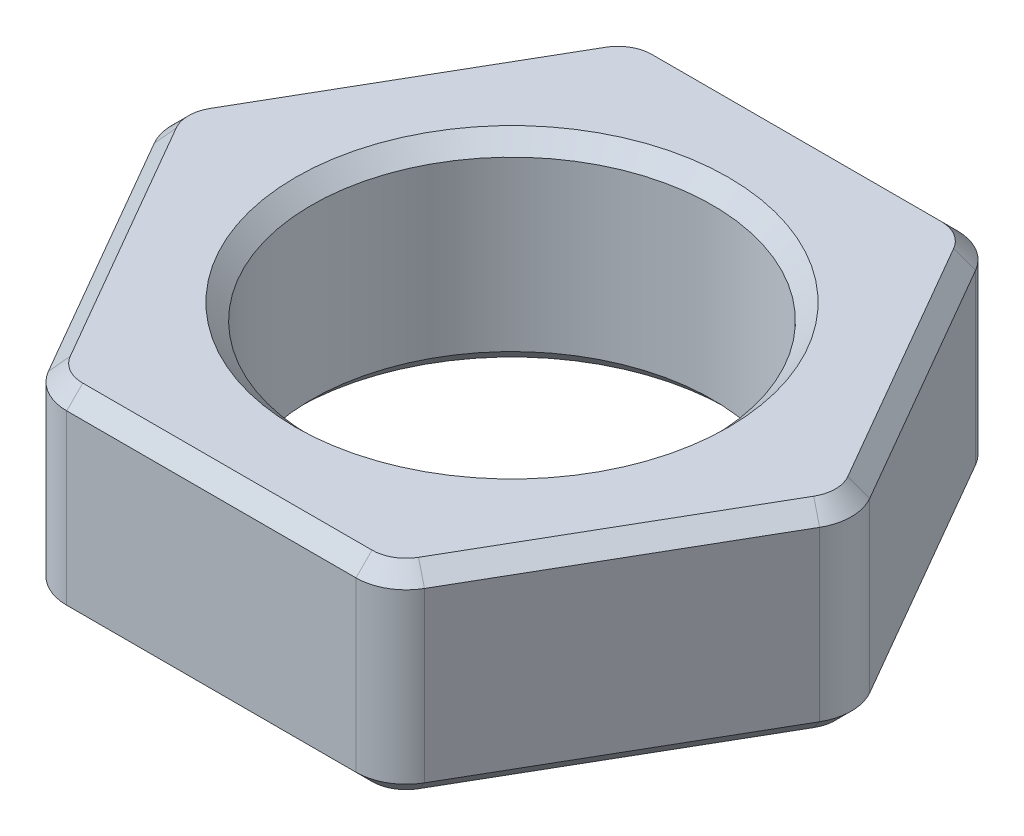
ISO-10303-21;
HEADER;
FILE_DESCRIPTION(('STEP AP214'),'2;1');
FILE_NAME('part.step','',(''),(''),'','','');
FILE_SCHEMA(('AUTOMOTIVE_DESIGN { 1 0 10303 214 1 1 1 1 }'));
ENDSEC;
DATA;
#1=APPLICATION_CONTEXT('core data for automotive mechanical design processes');
#2=APPLICATION_PROTOCOL_DEFINITION('international standard','automotive_design',2000,#1);
#3=PRODUCT_CONTEXT('',#1,'mechanical');
#4=PRODUCT('Part','Part','',(#3));
#5=PRODUCT_RELATED_PRODUCT_CATEGORY('part','',(#4));
#6=PRODUCT_DEFINITION_FORMATION('','',#4);
#7=PRODUCT_DEFINITION_CONTEXT('part definition',#1,'design');
#8=PRODUCT_DEFINITION('design','',#6,#7);
#9=PRODUCT_DEFINITION_SHAPE('','',#8);
#10=(LENGTH_UNIT() NAMED_UNIT(*) SI_UNIT(.MILLI.,.METRE.));
#11=(NAMED_UNIT(*) PLANE_ANGLE_UNIT() SI_UNIT($,.RADIAN.));
#12=(NAMED_UNIT(*) SI_UNIT($,.STERADIAN.) SOLID_ANGLE_UNIT());
#13=UNCERTAINTY_MEASURE_WITH_UNIT(LENGTH_MEASURE(1.E-05),#10,'distance_accuracy_value','');
#14=(GEOMETRIC_REPRESENTATION_CONTEXT(3) GLOBAL_UNCERTAINTY_ASSIGNED_CONTEXT((#13)) GLOBAL_UNIT_ASSIGNED_CONTEXT((#10,
#11,#12)) REPRESENTATION_CONTEXT('',''));
#15=CARTESIAN_POINT('',(0.,0.,0.));
#16=DIRECTION('',(0.,0.,1.));
#17=DIRECTION('',(1.,0.,0.));
#18=AXIS2_PLACEMENT_3D('',#15,#16,#17);
#19=CARTESIAN_POINT('',(0.,1.5875,0.));
#20=DIRECTION('',(0.,1.,0.));
#21=DIRECTION('',(0.,0.,1.));
#22=AXIS2_PLACEMENT_3D('',#19,#20,#21);
#23=PLANE('',#22);
#24=CARTESIAN_POINT('',(0.,1.5875,0.));
#25=DIRECTION('',(0.,1.,0.));
#26=DIRECTION('',(0.,0.,1.));
#27=AXIS2_PLACEMENT_3D('',#24,#25,#26);
#28=CIRCLE('',#27,3.429);
#29=CARTESIAN_POINT('',(0.,1.5875,3.429));
#30=VERTEX_POINT('',#29);
#31=EDGE_CURVE('E11',#30,#30,#28,.F.);
#32=ORIENTED_EDGE('',*,*,#31,.T.);
#33=EDGE_LOOP('',(#32));
#34=FACE_BOUND('',#33,.T.);
#35=DIRECTION('',(-1.,0.,0.));
#36=VECTOR('',#35,1.);
#37=CARTESIAN_POINT('',(-2.29135888084633,1.5875,-4.5085));
#38=LINE('',#37,#36);
#39=CARTESIAN_POINT('',(2.29135888084633,1.5875,-4.5085));
#40=VERTEX_POINT('',#39);
#41=CARTESIAN_POINT('',(-2.29135888084633,1.5875,-4.5085));
#42=VERTEX_POINT('',#41);
#43=EDGE_CURVE('E49',#40,#42,#38,.T.);
#44=ORIENTED_EDGE('',*,*,#43,.T.);
#45=CARTESIAN_POINT('',(-2.29135888084633,1.5875,-3.96875));
#46=DIRECTION('',(0.,1.,0.));
#47=DIRECTION('',(0.,0.,1.));
#48=AXIS2_PLACEMENT_3D('',#45,#46,#47);
#49=CIRCLE('',#48,0.539750000000003);
#50=CARTESIAN_POINT('',(-2.75879609253898,1.5875,-4.238625));
#51=VERTEX_POINT('',#50);
#52=EDGE_CURVE('E41',#42,#51,#49,.T.);
#53=ORIENTED_EDGE('',*,*,#52,.T.);
#54=DIRECTION('',(-0.5,0.,0.866025403784439));
#55=VECTOR('',#54,1.);
#56=CARTESIAN_POINT('',(-5.05015497338531,1.5875,-0.269875000000002));
#57=LINE('',#56,#55);
#58=CARTESIAN_POINT('',(-5.05015497338531,1.5875,-0.269875000000002));
#59=VERTEX_POINT('',#58);
#60=EDGE_CURVE('E283',#51,#59,#57,.T.);
#61=ORIENTED_EDGE('',*,*,#60,.T.);
#62=CARTESIAN_POINT('',(-4.58271776169265,1.5875,0.));
#63=DIRECTION('',(0.,1.,0.));
#64=DIRECTION('',(0.,0.,1.));
#65=AXIS2_PLACEMENT_3D('',#62,#63,#64);
#66=CIRCLE('',#65,0.539750000000002);
#67=CARTESIAN_POINT('',(-5.0501549733853,1.5875,0.269875000000002));
#68=VERTEX_POINT('',#67);
#69=EDGE_CURVE('E285',#59,#68,#66,.T.);
#70=ORIENTED_EDGE('',*,*,#69,.T.);
#71=DIRECTION('',(0.5,0.,0.866025403784439));
#72=VECTOR('',#71,1.);
#73=CARTESIAN_POINT('',(-2.75879609253897,1.5875,4.23862500000001));
#74=LINE('',#73,#72);
#75=CARTESIAN_POINT('',(-2.75879609253897,1.5875,4.23862500000001));
#76=VERTEX_POINT('',#75);
#77=EDGE_CURVE('E287',#68,#76,#74,.T.);
#78=ORIENTED_EDGE('',*,*,#77,.T.);
#79=CARTESIAN_POINT('',(-2.29135888084632,1.5875,3.96875));
#80=DIRECTION('',(0.,1.,0.));
#81=DIRECTION('',(0.,0.,1.));
#82=AXIS2_PLACEMENT_3D('',#79,#80,#81);
#83=CIRCLE('',#82,0.539750000000002);
#84=CARTESIAN_POINT('',(-2.29135888084632,1.5875,4.50850000000001));
#85=VERTEX_POINT('',#84);
#86=EDGE_CURVE('E289',#76,#85,#83,.T.);
#87=ORIENTED_EDGE('',*,*,#86,.T.);
#88=DIRECTION('',(1.,0.,0.));
#89=VECTOR('',#88,1.);
#90=CARTESIAN_POINT('',(2.29135888084633,1.5875,4.50850000000001));
#91=LINE('',#90,#89);
#92=CARTESIAN_POINT('',(2.29135888084633,1.5875,4.50850000000001));
#93=VERTEX_POINT('',#92);
#94=EDGE_CURVE('E291',#85,#93,#91,.T.);
#95=ORIENTED_EDGE('',*,*,#94,.T.);
#96=CARTESIAN_POINT('',(2.29135888084633,1.5875,3.96875));
#97=DIRECTION('',(0.,1.,0.));
#98=DIRECTION('',(0.,0.,1.));
#99=AXIS2_PLACEMENT_3D('',#96,#97,#98);
#100=CIRCLE('',#99,0.539750000000003);
#101=CARTESIAN_POINT('',(2.75879609253898,1.5875,4.238625));
#102=VERTEX_POINT('',#101);
#103=EDGE_CURVE('E293',#93,#102,#100,.T.);
#104=ORIENTED_EDGE('',*,*,#103,.T.);
#105=DIRECTION('',(0.5,0.,-0.866025403784439));
#106=VECTOR('',#105,1.);
#107=CARTESIAN_POINT('',(5.05015497338531,1.5875,0.269874999999998));
#108=LINE('',#107,#106);
#109=CARTESIAN_POINT('',(5.05015497338531,1.5875,0.269874999999998));
#110=VERTEX_POINT('',#109);
#111=EDGE_CURVE('E295',#102,#110,#108,.T.);
#112=ORIENTED_EDGE('',*,*,#111,.T.);
#113=CARTESIAN_POINT('',(4.58271776169266,1.5875,0.));
#114=DIRECTION('',(0.,1.,0.));
#115=DIRECTION('',(0.,0.,1.));
#116=AXIS2_PLACEMENT_3D('',#113,#114,#115);
#117=CIRCLE('',#116,0.539750000000003);
#118=CARTESIAN_POINT('',(5.05015497338531,1.5875,-0.269875000000004));
#119=VERTEX_POINT('',#118);
#120=EDGE_CURVE('E297',#110,#119,#117,.T.);
#121=ORIENTED_EDGE('',*,*,#120,.T.);
#122=DIRECTION('',(-0.5,0.,-0.866025403784439));
#123=VECTOR('',#122,1.);
#124=CARTESIAN_POINT('',(2.75879609253898,1.5875,-4.238625));
#125=LINE('',#124,#123);
#126=CARTESIAN_POINT('',(2.75879609253898,1.5875,-4.238625));
#127=VERTEX_POINT('',#126);
#128=EDGE_CURVE('E299',#119,#127,#125,.T.);
#129=ORIENTED_EDGE('',*,*,#128,.T.);
#130=CARTESIAN_POINT('',(2.29135888084633,1.5875,-3.96875));
#131=DIRECTION('',(0.,1.,0.));
#132=DIRECTION('',(0.,0.,1.));
#133=AXIS2_PLACEMENT_3D('',#130,#131,#132);
#134=CIRCLE('',#133,0.539750000000002);
#135=EDGE_CURVE('E54',#127,#40,#134,.T.);
#136=ORIENTED_EDGE('',*,*,#135,.T.);
#137=EDGE_LOOP('',(#44,#53,#61,#70,#78,#87,#95,#104,#112,#121,#129,#136));
#138=FACE_BOUND('',#137,.T.);
#139=ADVANCED_FACE('F32',(#34,#138),#23,.T.);
#140=CARTESIAN_POINT('',(0.,-1.5875,0.));
#141=DIRECTION('',(0.,1.,0.));
#142=DIRECTION('',(0.,0.,1.));
#143=AXIS2_PLACEMENT_3D('',#140,#141,#142);
#144=PLANE('',#143);
#145=CARTESIAN_POINT('',(0.,-1.5875,0.));
#146=DIRECTION('',(0.,1.,0.));
#147=DIRECTION('',(0.,0.,1.));
#148=AXIS2_PLACEMENT_3D('',#145,#146,#147);
#149=CIRCLE('',#148,3.429);
#150=CARTESIAN_POINT('',(0.,-1.5875,3.429));
#151=VERTEX_POINT('',#150);
#152=EDGE_CURVE('E221',#151,#151,#149,.T.);
#153=ORIENTED_EDGE('',*,*,#152,.T.);
#154=EDGE_LOOP('',(#153));
#155=FACE_BOUND('',#154,.T.);
#156=DIRECTION('',(-1.,0.,0.));
#157=VECTOR('',#156,1.);
#158=CARTESIAN_POINT('',(0.,-1.5875,4.5085));
#159=LINE('',#158,#157);
#160=CARTESIAN_POINT('',(2.29135888084633,-1.5875,4.5085));
#161=VERTEX_POINT('',#160);
#162=CARTESIAN_POINT('',(-2.29135888084632,-1.5875,4.5085));
#163=VERTEX_POINT('',#162);
#164=EDGE_CURVE('E219',#161,#163,#159,.T.);
#165=ORIENTED_EDGE('',*,*,#164,.T.);
#166=CARTESIAN_POINT('',(-2.29135888084632,-1.5875,3.96875));
#167=DIRECTION('',(0.,1.,0.));
#168=DIRECTION('',(0.,0.,1.));
#169=AXIS2_PLACEMENT_3D('',#166,#167,#168);
#170=CIRCLE('',#169,0.539749999999996);
#171=CARTESIAN_POINT('',(-2.75879609253897,-1.5875,4.238625));
#172=VERTEX_POINT('',#171);
#173=EDGE_CURVE('E200',#163,#172,#170,.F.);
#174=ORIENTED_EDGE('',*,*,#173,.T.);
#175=DIRECTION('',(-0.5,0.,-0.866025403784439));
#176=VECTOR('',#175,1.);
#177=CARTESIAN_POINT('',(-3.90447553296214,-1.5875,2.25425));
#178=LINE('',#177,#176);
#179=CARTESIAN_POINT('',(-5.0501549733853,-1.5875,0.269874999999999));
#180=VERTEX_POINT('',#179);
#181=EDGE_CURVE('E208',#172,#180,#178,.T.);
#182=ORIENTED_EDGE('',*,*,#181,.T.);
#183=CARTESIAN_POINT('',(-4.58271776169265,-1.5875,0.));
#184=DIRECTION('',(0.,1.,0.));
#185=DIRECTION('',(0.,0.,1.));
#186=AXIS2_PLACEMENT_3D('',#183,#184,#185);
#187=CIRCLE('',#186,0.539749999999996);
#188=CARTESIAN_POINT('',(-5.0501549733853,-1.5875,-0.269874999999999));
#189=VERTEX_POINT('',#188);
#190=EDGE_CURVE('E214',#180,#189,#187,.F.);
#191=ORIENTED_EDGE('',*,*,#190,.T.);
#192=DIRECTION('',(0.5,0.,-0.866025403784439));
#193=VECTOR('',#192,1.);
#194=CARTESIAN_POINT('',(-3.90447553296214,-1.5875,-2.25425));
#195=LINE('',#194,#193);
#196=CARTESIAN_POINT('',(-2.75879609253897,-1.5875,-4.238625));
#197=VERTEX_POINT('',#196);
#198=EDGE_CURVE('E399',#189,#197,#195,.T.);
#199=ORIENTED_EDGE('',*,*,#198,.T.);
#200=CARTESIAN_POINT('',(-2.29135888084633,-1.5875,-3.96875));
#201=DIRECTION('',(0.,1.,0.));
#202=DIRECTION('',(0.,0.,1.));
#203=AXIS2_PLACEMENT_3D('',#200,#201,#202);
#204=CIRCLE('',#203,0.539749999999997);
#205=CARTESIAN_POINT('',(-2.29135888084633,-1.5875,-4.5085));
#206=VERTEX_POINT('',#205);
#207=EDGE_CURVE('E401',#197,#206,#204,.F.);
#208=ORIENTED_EDGE('',*,*,#207,.T.);
#209=DIRECTION('',(1.,0.,0.));
#210=VECTOR('',#209,1.);
#211=CARTESIAN_POINT('',(0.,-1.5875,-4.5085));
#212=LINE('',#211,#210);
#213=CARTESIAN_POINT('',(2.29135888084633,-1.5875,-4.5085));
#214=VERTEX_POINT('',#213);
#215=EDGE_CURVE('E403',#206,#214,#212,.T.);
#216=ORIENTED_EDGE('',*,*,#215,.T.);
#217=CARTESIAN_POINT('',(2.29135888084633,-1.5875,-3.96875));
#218=DIRECTION('',(0.,1.,0.));
#219=DIRECTION('',(0.,0.,1.));
#220=AXIS2_PLACEMENT_3D('',#217,#218,#219);
#221=CIRCLE('',#220,0.539749999999997);
#222=CARTESIAN_POINT('',(2.75879609253897,-1.5875,-4.238625));
#223=VERTEX_POINT('',#222);
#224=EDGE_CURVE('E405',#214,#223,#221,.F.);
#225=ORIENTED_EDGE('',*,*,#224,.T.);
#226=DIRECTION('',(0.5,0.,0.866025403784439));
#227=VECTOR('',#226,1.);
#228=CARTESIAN_POINT('',(3.90447553296214,-1.5875,-2.25425));
#229=LINE('',#228,#227);
#230=CARTESIAN_POINT('',(5.0501549733853,-1.5875,-0.269875000000001));
#231=VERTEX_POINT('',#230);
#232=EDGE_CURVE('E407',#223,#231,#229,.T.);
#233=ORIENTED_EDGE('',*,*,#232,.T.);
#234=CARTESIAN_POINT('',(4.58271776169266,-1.5875,0.));
#235=DIRECTION('',(0.,1.,0.));
#236=DIRECTION('',(0.,0.,1.));
#237=AXIS2_PLACEMENT_3D('',#234,#235,#236);
#238=CIRCLE('',#237,0.539749999999997);
#239=CARTESIAN_POINT('',(5.0501549733853,-1.5875,0.269874999999995));
#240=VERTEX_POINT('',#239);
#241=EDGE_CURVE('E409',#231,#240,#238,.F.);
#242=ORIENTED_EDGE('',*,*,#241,.T.);
#243=DIRECTION('',(-0.5,0.,0.866025403784439));
#244=VECTOR('',#243,1.);
#245=CARTESIAN_POINT('',(3.90447553296214,-1.5875,2.25425));
#246=LINE('',#245,#244);
#247=CARTESIAN_POINT('',(2.75879609253898,-1.5875,4.238625));
#248=VERTEX_POINT('',#247);
#249=EDGE_CURVE('E411',#240,#248,#246,.T.);
#250=ORIENTED_EDGE('',*,*,#249,.T.);
#251=CARTESIAN_POINT('',(2.29135888084633,-1.5875,3.96875));
#252=DIRECTION('',(0.,1.,0.));
#253=DIRECTION('',(0.,0.,1.));
#254=AXIS2_PLACEMENT_3D('',#251,#252,#253);
#255=CIRCLE('',#254,0.539749999999997);
#256=EDGE_CURVE('E226',#248,#161,#255,.F.);
#257=ORIENTED_EDGE('',*,*,#256,.T.);
#258=EDGE_LOOP('',(#165,#174,#182,#191,#199,#208,#216,#225,#233,#242,#250,#257));
#259=FACE_BOUND('',#258,.T.);
#260=ADVANCED_FACE('F217',(#155,#259),#144,.F.);
#261=CARTESIAN_POINT('',(5.49926131403119,1.5875,0.));
#262=DIRECTION('',(-0.866025403784438,0.,0.5));
#263=DIRECTION('',(0.5,0.,0.866025403784439));
#264=AXIS2_PLACEMENT_3D('',#261,#262,#263);
#265=PLANE('',#264);
#266=DIRECTION('',(0.,-1.,0.));
#267=VECTOR('',#266,1.);
#268=CARTESIAN_POINT('',(5.27012542594655,1.5875,-0.396875000000003));
#269=LINE('',#268,#267);
#270=CARTESIAN_POINT('',(5.27012542594655,1.3335,-0.396875000000003));
#271=VERTEX_POINT('',#270);
#272=CARTESIAN_POINT('',(5.27012542594655,-1.3335,-0.396875000000003));
#273=VERTEX_POINT('',#272);
#274=EDGE_CURVE('E445',#271,#273,#269,.T.);
#275=ORIENTED_EDGE('',*,*,#274,.T.);
#276=DIRECTION('',(-0.5,0.,-0.866025403784439));
#277=VECTOR('',#276,1.);
#278=CARTESIAN_POINT('',(5.49926131403119,-1.3335,0.));
#279=LINE('',#278,#277);
#280=CARTESIAN_POINT('',(2.97876654510023,-1.3335,-4.365625));
#281=VERTEX_POINT('',#280);
#282=EDGE_CURVE('E256',#273,#281,#279,.T.);
#283=ORIENTED_EDGE('',*,*,#282,.T.);
#284=DIRECTION('',(0.,-1.,0.));
#285=VECTOR('',#284,1.);
#286=CARTESIAN_POINT('',(2.97876654510023,1.5875,-4.365625));
#287=LINE('',#286,#285);
#288=CARTESIAN_POINT('',(2.97876654510023,1.3335,-4.365625));
#289=VERTEX_POINT('',#288);
#290=EDGE_CURVE('E448',#281,#289,#287,.F.);
#291=ORIENTED_EDGE('',*,*,#290,.T.);
#292=DIRECTION('',(0.5,0.,0.866025403784439));
#293=VECTOR('',#292,1.);
#294=CARTESIAN_POINT('',(5.27012542594655,1.3335,-0.396875000000003));
#295=LINE('',#294,#293);
#296=EDGE_CURVE('E254',#289,#271,#295,.T.);
#297=ORIENTED_EDGE('',*,*,#296,.T.);
#298=EDGE_LOOP('',(#275,#283,#291,#297));
#299=FACE_BOUND('',#298,.T.);
#300=ADVANCED_FACE('F468',(#299),#265,.F.);
#301=CARTESIAN_POINT('',(2.74963065701559,1.5875,-4.7625));
#302=DIRECTION('',(0.,0.,1.));
#303=DIRECTION('',(1.,0.,0.));
#304=AXIS2_PLACEMENT_3D('',#301,#302,#303);
#305=PLANE('',#304);
#306=DIRECTION('',(0.,-1.,0.));
#307=VECTOR('',#306,1.);
#308=CARTESIAN_POINT('',(2.29135888084633,1.5875,-4.7625));
#309=LINE('',#308,#307);
#310=CARTESIAN_POINT('',(2.29135888084633,1.3335,-4.7625));
#311=VERTEX_POINT('',#310);
#312=CARTESIAN_POINT('',(2.29135888084633,-1.3335,-4.7625));
#313=VERTEX_POINT('',#312);
#314=EDGE_CURVE('E439',#311,#313,#309,.T.);
#315=ORIENTED_EDGE('',*,*,#314,.T.);
#316=DIRECTION('',(-1.,0.,0.));
#317=VECTOR('',#316,1.);
#318=CARTESIAN_POINT('',(2.74963065701559,-1.3335,-4.7625));
#319=LINE('',#318,#317);
#320=CARTESIAN_POINT('',(-2.29135888084633,-1.3335,-4.7625));
#321=VERTEX_POINT('',#320);
#322=EDGE_CURVE('E264',#313,#321,#319,.T.);
#323=ORIENTED_EDGE('',*,*,#322,.T.);
#324=DIRECTION('',(0.,-1.,0.));
#325=VECTOR('',#324,1.);
#326=CARTESIAN_POINT('',(-2.29135888084633,1.5875,-4.7625));
#327=LINE('',#326,#325);
#328=CARTESIAN_POINT('',(-2.29135888084633,1.3335,-4.7625));
#329=VERTEX_POINT('',#328);
#330=EDGE_CURVE('E442',#321,#329,#327,.F.);
#331=ORIENTED_EDGE('',*,*,#330,.T.);
#332=DIRECTION('',(1.,0.,0.));
#333=VECTOR('',#332,1.);
#334=CARTESIAN_POINT('',(2.29135888084633,1.3335,-4.7625));
#335=LINE('',#334,#333);
#336=EDGE_CURVE('E262',#329,#311,#335,.T.);
#337=ORIENTED_EDGE('',*,*,#336,.T.);
#338=EDGE_LOOP('',(#315,#323,#331,#337));
#339=FACE_BOUND('',#338,.T.);
#340=ADVANCED_FACE('F486',(#339),#305,.F.);
#341=CARTESIAN_POINT('',(-2.74963065701559,1.5875,-4.7625));
#342=DIRECTION('',(0.866025403784439,0.,0.5));
#343=DIRECTION('',(0.5,0.,-0.866025403784439));
#344=AXIS2_PLACEMENT_3D('',#341,#342,#343);
#345=PLANE('',#344);
#346=DIRECTION('',(0.,-1.,0.));
#347=VECTOR('',#346,1.);
#348=CARTESIAN_POINT('',(-2.97876654510023,1.5875,-4.365625));
#349=LINE('',#348,#347);
#350=CARTESIAN_POINT('',(-2.97876654510023,1.3335,-4.365625));
#351=VERTEX_POINT('',#350);
#352=CARTESIAN_POINT('',(-2.97876654510023,-1.3335,-4.365625));
#353=VERTEX_POINT('',#352);
#354=EDGE_CURVE('E431',#351,#353,#349,.T.);
#355=ORIENTED_EDGE('',*,*,#354,.T.);
#356=DIRECTION('',(-0.5,0.,0.866025403784439));
#357=VECTOR('',#356,1.);
#358=CARTESIAN_POINT('',(-2.74963065701559,-1.3335,-4.7625));
#359=LINE('',#358,#357);
#360=CARTESIAN_POINT('',(-5.27012542594655,-1.3335,-0.396875000000001));
#361=VERTEX_POINT('',#360);
#362=EDGE_CURVE('E273',#353,#361,#359,.T.);
#363=ORIENTED_EDGE('',*,*,#362,.T.);
#364=DIRECTION('',(0.,-1.,0.));
#365=VECTOR('',#364,1.);
#366=CARTESIAN_POINT('',(-5.27012542594655,1.5875,-0.396875000000001));
#367=LINE('',#366,#365);
#368=CARTESIAN_POINT('',(-5.27012542594655,1.3335,-0.396875000000001));
#369=VERTEX_POINT('',#368);
#370=EDGE_CURVE('E436',#361,#369,#367,.F.);
#371=ORIENTED_EDGE('',*,*,#370,.T.);
#372=DIRECTION('',(0.5,0.,-0.866025403784439));
#373=VECTOR('',#372,1.);
#374=CARTESIAN_POINT('',(-2.97876654510023,1.3335,-4.365625));
#375=LINE('',#374,#373);
#376=EDGE_CURVE('E271',#369,#351,#375,.T.);
#377=ORIENTED_EDGE('',*,*,#376,.T.);
#378=EDGE_LOOP('',(#355,#363,#371,#377));
#379=FACE_BOUND('',#378,.T.);
#380=ADVANCED_FACE('F524',(#379),#345,.F.);
#381=CARTESIAN_POINT('',(-5.49926131403118,1.5875,0.));
#382=DIRECTION('',(0.866025403784438,0.,-0.5));
#383=DIRECTION('',(-0.5,0.,-0.866025403784439));
#384=AXIS2_PLACEMENT_3D('',#381,#382,#383);
#385=PLANE('',#384);
#386=DIRECTION('',(0.,-1.,0.));
#387=VECTOR('',#386,1.);
#388=CARTESIAN_POINT('',(-5.27012542594655,1.5875,0.396875000000001));
#389=LINE('',#388,#387);
#390=CARTESIAN_POINT('',(-5.27012542594655,1.3335,0.396875000000001));
#391=VERTEX_POINT('',#390);
#392=CARTESIAN_POINT('',(-5.27012542594655,-1.3335,0.396875000000001));
#393=VERTEX_POINT('',#392);
#394=EDGE_CURVE('E428',#391,#393,#389,.T.);
#395=ORIENTED_EDGE('',*,*,#394,.T.);
#396=DIRECTION('',(0.5,0.,0.866025403784439));
#397=VECTOR('',#396,1.);
#398=CARTESIAN_POINT('',(-5.49926131403118,-1.3335,0.));
#399=LINE('',#398,#397);
#400=CARTESIAN_POINT('',(-2.97876654510022,-1.3335,4.365625));
#401=VERTEX_POINT('',#400);
#402=EDGE_CURVE('E281',#393,#401,#399,.T.);
#403=ORIENTED_EDGE('',*,*,#402,.T.);
#404=DIRECTION('',(0.,-1.,0.));
#405=VECTOR('',#404,1.);
#406=CARTESIAN_POINT('',(-2.97876654510022,1.5875,4.365625));
#407=LINE('',#406,#405);
#408=CARTESIAN_POINT('',(-2.97876654510022,1.3335,4.365625));
#409=VERTEX_POINT('',#408);
#410=EDGE_CURVE('E333',#401,#409,#407,.F.);
#411=ORIENTED_EDGE('',*,*,#410,.T.);
#412=DIRECTION('',(-0.5,0.,-0.866025403784439));
#413=VECTOR('',#412,1.);
#414=CARTESIAN_POINT('',(-5.27012542594655,1.3335,0.396875000000001));
#415=LINE('',#414,#413);
#416=EDGE_CURVE('E279',#409,#391,#415,.T.);
#417=ORIENTED_EDGE('',*,*,#416,.T.);
#418=EDGE_LOOP('',(#395,#403,#411,#417));
#419=FACE_BOUND('',#418,.T.);
#420=ADVANCED_FACE('F521',(#419),#385,.F.);
#421=CARTESIAN_POINT('',(-2.74963065701559,1.5875,4.7625));
#422=DIRECTION('',(0.,0.,-1.));
#423=DIRECTION('',(-1.,0.,0.));
#424=AXIS2_PLACEMENT_3D('',#421,#422,#423);
#425=PLANE('',#424);
#426=DIRECTION('',(0.,-1.,0.));
#427=VECTOR('',#426,1.);
#428=CARTESIAN_POINT('',(-2.29135888084632,1.5875,4.7625));
#429=LINE('',#428,#427);
#430=CARTESIAN_POINT('',(-2.29135888084632,1.3335,4.7625));
#431=VERTEX_POINT('',#430);
#432=CARTESIAN_POINT('',(-2.29135888084632,-1.3335,4.7625));
#433=VERTEX_POINT('',#432);
#434=EDGE_CURVE('E215',#431,#433,#429,.T.);
#435=ORIENTED_EDGE('',*,*,#434,.T.);
#436=DIRECTION('',(1.,0.,0.));
#437=VECTOR('',#436,1.);
#438=CARTESIAN_POINT('',(-2.74963065701559,-1.3335,4.7625));
#439=LINE('',#438,#437);
#440=CARTESIAN_POINT('',(2.29135888084633,-1.3335,4.7625));
#441=VERTEX_POINT('',#440);
#442=EDGE_CURVE('E240',#433,#441,#439,.T.);
#443=ORIENTED_EDGE('',*,*,#442,.T.);
#444=DIRECTION('',(0.,-1.,0.));
#445=VECTOR('',#444,1.);
#446=CARTESIAN_POINT('',(2.29135888084633,1.5875,4.7625));
#447=LINE('',#446,#445);
#448=CARTESIAN_POINT('',(2.29135888084633,1.3335,4.7625));
#449=VERTEX_POINT('',#448);
#450=EDGE_CURVE('E382',#441,#449,#447,.F.);
#451=ORIENTED_EDGE('',*,*,#450,.T.);
#452=DIRECTION('',(-1.,0.,0.));
#453=VECTOR('',#452,1.);
#454=CARTESIAN_POINT('',(-2.29135888084632,1.3335,4.7625));
#455=LINE('',#454,#453);
#456=EDGE_CURVE('E238',#449,#431,#455,.T.);
#457=ORIENTED_EDGE('',*,*,#456,.T.);
#458=EDGE_LOOP('',(#435,#443,#451,#457));
#459=FACE_BOUND('',#458,.T.);
#460=ADVANCED_FACE('F388',(#459),#425,.F.);
#461=CARTESIAN_POINT('',(2.74963065701559,1.5875,4.7625));
#462=DIRECTION('',(-0.866025403784439,0.,-0.5));
#463=DIRECTION('',(-0.5,0.,0.866025403784439));
#464=AXIS2_PLACEMENT_3D('',#461,#462,#463);
#465=PLANE('',#464);
#466=DIRECTION('',(0.,-1.,0.));
#467=VECTOR('',#466,1.);
#468=CARTESIAN_POINT('',(2.97876654510023,1.5875,4.365625));
#469=LINE('',#468,#467);
#470=CARTESIAN_POINT('',(2.97876654510023,1.3335,4.365625));
#471=VERTEX_POINT('',#470);
#472=CARTESIAN_POINT('',(2.97876654510023,-1.3335,4.365625));
#473=VERTEX_POINT('',#472);
#474=EDGE_CURVE('E385',#471,#473,#469,.T.);
#475=ORIENTED_EDGE('',*,*,#474,.T.);
#476=DIRECTION('',(0.5,0.,-0.866025403784439));
#477=VECTOR('',#476,1.);
#478=CARTESIAN_POINT('',(2.74963065701559,-1.3335,4.7625));
#479=LINE('',#478,#477);
#480=CARTESIAN_POINT('',(5.27012542594655,-1.3335,0.396874999999997));
#481=VERTEX_POINT('',#480);
#482=EDGE_CURVE('E248',#473,#481,#479,.T.);
#483=ORIENTED_EDGE('',*,*,#482,.T.);
#484=DIRECTION('',(0.,-1.,0.));
#485=VECTOR('',#484,1.);
#486=CARTESIAN_POINT('',(5.27012542594655,1.5875,0.396874999999997));
#487=LINE('',#486,#485);
#488=CARTESIAN_POINT('',(5.27012542594655,1.3335,0.396874999999997));
#489=VERTEX_POINT('',#488);
#490=EDGE_CURVE('E391',#481,#489,#487,.F.);
#491=ORIENTED_EDGE('',*,*,#490,.T.);
#492=DIRECTION('',(-0.5,0.,0.866025403784439));
#493=VECTOR('',#492,1.);
#494=CARTESIAN_POINT('',(2.97876654510023,1.3335,4.365625));
#495=LINE('',#494,#493);
#496=EDGE_CURVE('E246',#489,#471,#495,.T.);
#497=ORIENTED_EDGE('',*,*,#496,.T.);
#498=EDGE_LOOP('',(#475,#483,#491,#497));
#499=FACE_BOUND('',#498,.T.);
#500=ADVANCED_FACE('F452',(#499),#465,.F.);
#501=CARTESIAN_POINT('',(0.,1.5875,0.));
#502=DIRECTION('',(0.,-1.,0.));
#503=DIRECTION('',(0.,0.,-1.));
#504=AXIS2_PLACEMENT_3D('',#501,#502,#503);
#505=CYLINDRICAL_SURFACE('',#504,3.175);
#506=CARTESIAN_POINT('',(0.,-1.3335,0.));
#507=DIRECTION('',(0.,1.,0.));
#508=DIRECTION('',(0.,0.,1.));
#509=AXIS2_PLACEMENT_3D('',#506,#507,#508);
#510=CIRCLE('',#509,3.175);
#511=CARTESIAN_POINT('',(0.,-1.3335,3.175));
#512=VERTEX_POINT('',#511);
#513=EDGE_CURVE('E232',#512,#512,#510,.F.);
#514=ORIENTED_EDGE('',*,*,#513,.T.);
#515=EDGE_LOOP('',(#514));
#516=FACE_BOUND('',#515,.T.);
#517=CARTESIAN_POINT('',(0.,1.3335,0.));
#518=DIRECTION('',(0.,1.,0.));
#519=DIRECTION('',(0.,0.,1.));
#520=AXIS2_PLACEMENT_3D('',#517,#518,#519);
#521=CIRCLE('',#520,3.175);
#522=CARTESIAN_POINT('',(0.,1.3335,3.175));
#523=VERTEX_POINT('',#522);
#524=EDGE_CURVE('E224',#523,#523,#521,.T.);
#525=ORIENTED_EDGE('',*,*,#524,.T.);
#526=EDGE_LOOP('',(#525));
#527=FACE_BOUND('',#526,.T.);
#528=ADVANCED_FACE('F515',(#516,#527),#505,.F.);
#529=CARTESIAN_POINT('',(-4.58271776169265,1.5875,0.));
#530=DIRECTION('',(0.,-1.,0.));
#531=DIRECTION('',(0.,0.,-1.));
#532=AXIS2_PLACEMENT_3D('',#529,#530,#531);
#533=CYLINDRICAL_SURFACE('',#532,0.79375);
#534=ORIENTED_EDGE('',*,*,#370,.F.);
#535=CARTESIAN_POINT('',(-4.58271776169265,-1.3335,0.));
#536=DIRECTION('',(0.,1.,0.));
#537=DIRECTION('',(0.,0.,1.));
#538=AXIS2_PLACEMENT_3D('',#535,#536,#537);
#539=CIRCLE('',#538,0.79375);
#540=EDGE_CURVE('E277',#361,#393,#539,.T.);
#541=ORIENTED_EDGE('',*,*,#540,.T.);
#542=ORIENTED_EDGE('',*,*,#394,.F.);
#543=CARTESIAN_POINT('',(-4.58271776169265,1.3335,0.));
#544=DIRECTION('',(0.,1.,0.));
#545=DIRECTION('',(0.,0.,1.));
#546=AXIS2_PLACEMENT_3D('',#543,#544,#545);
#547=CIRCLE('',#546,0.79375);
#548=EDGE_CURVE('E275',#391,#369,#547,.F.);
#549=ORIENTED_EDGE('',*,*,#548,.T.);
#550=EDGE_LOOP('',(#534,#541,#542,#549));
#551=FACE_BOUND('',#550,.T.);
#552=ADVANCED_FACE('F532',(#551),#533,.T.);
#553=CARTESIAN_POINT('',(-2.29135888084633,1.5875,-3.96875));
#554=DIRECTION('',(0.,-1.,0.));
#555=DIRECTION('',(0.,0.,-1.));
#556=AXIS2_PLACEMENT_3D('',#553,#554,#555);
#557=CYLINDRICAL_SURFACE('',#556,0.79375);
#558=ORIENTED_EDGE('',*,*,#330,.F.);
#559=CARTESIAN_POINT('',(-2.29135888084633,-1.3335,-3.96875));
#560=DIRECTION('',(0.,1.,0.));
#561=DIRECTION('',(0.,0.,1.));
#562=AXIS2_PLACEMENT_3D('',#559,#560,#561);
#563=CIRCLE('',#562,0.79375);
#564=EDGE_CURVE('E269',#321,#353,#563,.T.);
#565=ORIENTED_EDGE('',*,*,#564,.T.);
#566=ORIENTED_EDGE('',*,*,#354,.F.);
#567=CARTESIAN_POINT('',(-2.29135888084633,1.3335,-3.96875));
#568=DIRECTION('',(0.,1.,0.));
#569=DIRECTION('',(0.,0.,1.));
#570=AXIS2_PLACEMENT_3D('',#567,#568,#569);
#571=CIRCLE('',#570,0.79375);
#572=EDGE_CURVE('E266',#351,#329,#571,.F.);
#573=ORIENTED_EDGE('',*,*,#572,.T.);
#574=EDGE_LOOP('',(#558,#565,#566,#573));
#575=FACE_BOUND('',#574,.T.);
#576=ADVANCED_FACE('F495',(#575),#557,.T.);
#577=CARTESIAN_POINT('',(2.29135888084633,1.5875,-3.96875));
#578=DIRECTION('',(0.,-1.,0.));
#579=DIRECTION('',(0.,0.,-1.));
#580=AXIS2_PLACEMENT_3D('',#577,#578,#579);
#581=CYLINDRICAL_SURFACE('',#580,0.79375);
#582=ORIENTED_EDGE('',*,*,#290,.F.);
#583=CARTESIAN_POINT('',(2.29135888084633,-1.3335,-3.96875));
#584=DIRECTION('',(0.,1.,0.));
#585=DIRECTION('',(0.,0.,1.));
#586=AXIS2_PLACEMENT_3D('',#583,#584,#585);
#587=CIRCLE('',#586,0.79375);
#588=EDGE_CURVE('E260',#281,#313,#587,.T.);
#589=ORIENTED_EDGE('',*,*,#588,.T.);
#590=ORIENTED_EDGE('',*,*,#314,.F.);
#591=CARTESIAN_POINT('',(2.29135888084633,1.3335,-3.96875));
#592=DIRECTION('',(0.,1.,0.));
#593=DIRECTION('',(0.,0.,1.));
#594=AXIS2_PLACEMENT_3D('',#591,#592,#593);
#595=CIRCLE('',#594,0.79375);
#596=EDGE_CURVE('E258',#311,#289,#595,.F.);
#597=ORIENTED_EDGE('',*,*,#596,.T.);
#598=EDGE_LOOP('',(#582,#589,#590,#597));
#599=FACE_BOUND('',#598,.T.);
#600=ADVANCED_FACE('F483',(#599),#581,.T.);
#601=CARTESIAN_POINT('',(4.58271776169266,1.5875,0.));
#602=DIRECTION('',(0.,-1.,0.));
#603=DIRECTION('',(0.,0.,-1.));
#604=AXIS2_PLACEMENT_3D('',#601,#602,#603);
#605=CYLINDRICAL_SURFACE('',#604,0.79375);
#606=ORIENTED_EDGE('',*,*,#490,.F.);
#607=CARTESIAN_POINT('',(4.58271776169266,-1.3335,0.));
#608=DIRECTION('',(0.,1.,0.));
#609=DIRECTION('',(0.,0.,1.));
#610=AXIS2_PLACEMENT_3D('',#607,#608,#609);
#611=CIRCLE('',#610,0.79375);
#612=EDGE_CURVE('E252',#481,#273,#611,.T.);
#613=ORIENTED_EDGE('',*,*,#612,.T.);
#614=ORIENTED_EDGE('',*,*,#274,.F.);
#615=CARTESIAN_POINT('',(4.58271776169266,1.3335,0.));
#616=DIRECTION('',(0.,1.,0.));
#617=DIRECTION('',(0.,0.,1.));
#618=AXIS2_PLACEMENT_3D('',#615,#616,#617);
#619=CIRCLE('',#618,0.79375);
#620=EDGE_CURVE('E250',#271,#489,#619,.F.);
#621=ORIENTED_EDGE('',*,*,#620,.T.);
#622=EDGE_LOOP('',(#606,#613,#614,#621));
#623=FACE_BOUND('',#622,.T.);
#624=ADVANCED_FACE('F464',(#623),#605,.T.);
#625=CARTESIAN_POINT('',(-2.29135888084632,1.5875,3.96875));
#626=DIRECTION('',(0.,-1.,0.));
#627=DIRECTION('',(0.,0.,-1.));
#628=AXIS2_PLACEMENT_3D('',#625,#626,#627);
#629=CYLINDRICAL_SURFACE('',#628,0.79375);
#630=ORIENTED_EDGE('',*,*,#410,.F.);
#631=CARTESIAN_POINT('',(-2.29135888084632,-1.3335,3.96875));
#632=DIRECTION('',(0.,1.,0.));
#633=DIRECTION('',(0.,0.,1.));
#634=AXIS2_PLACEMENT_3D('',#631,#632,#633);
#635=CIRCLE('',#634,0.79375);
#636=EDGE_CURVE('E202',#401,#433,#635,.T.);
#637=ORIENTED_EDGE('',*,*,#636,.T.);
#638=ORIENTED_EDGE('',*,*,#434,.F.);
#639=CARTESIAN_POINT('',(-2.29135888084632,1.3335,3.96875));
#640=DIRECTION('',(0.,1.,0.));
#641=DIRECTION('',(0.,0.,1.));
#642=AXIS2_PLACEMENT_3D('',#639,#640,#641);
#643=CIRCLE('',#642,0.79375);
#644=EDGE_CURVE('E235',#431,#409,#643,.F.);
#645=ORIENTED_EDGE('',*,*,#644,.T.);
#646=EDGE_LOOP('',(#630,#637,#638,#645));
#647=FACE_BOUND('',#646,.T.);
#648=ADVANCED_FACE('F422',(#647),#629,.T.);
#649=CARTESIAN_POINT('',(2.29135888084633,1.5875,3.96875));
#650=DIRECTION('',(0.,-1.,0.));
#651=DIRECTION('',(0.,0.,-1.));
#652=AXIS2_PLACEMENT_3D('',#649,#650,#651);
#653=CYLINDRICAL_SURFACE('',#652,0.79375);
#654=ORIENTED_EDGE('',*,*,#450,.F.);
#655=CARTESIAN_POINT('',(2.29135888084633,-1.3335,3.96875));
#656=DIRECTION('',(0.,1.,0.));
#657=DIRECTION('',(0.,0.,1.));
#658=AXIS2_PLACEMENT_3D('',#655,#656,#657);
#659=CIRCLE('',#658,0.79375);
#660=EDGE_CURVE('E244',#441,#473,#659,.T.);
#661=ORIENTED_EDGE('',*,*,#660,.T.);
#662=ORIENTED_EDGE('',*,*,#474,.F.);
#663=CARTESIAN_POINT('',(2.29135888084633,1.3335,3.96875));
#664=DIRECTION('',(0.,1.,0.));
#665=DIRECTION('',(0.,0.,1.));
#666=AXIS2_PLACEMENT_3D('',#663,#664,#665);
#667=CIRCLE('',#666,0.79375);
#668=EDGE_CURVE('E242',#471,#449,#667,.F.);
#669=ORIENTED_EDGE('',*,*,#668,.T.);
#670=EDGE_LOOP('',(#654,#661,#662,#669));
#671=FACE_BOUND('',#670,.T.);
#672=ADVANCED_FACE('F381',(#671),#653,.T.);
#673=CARTESIAN_POINT('',(0.,-1.5875,0.));
#674=DIRECTION('',(0.,-1.,0.));
#675=DIRECTION('',(0.,0.,-1.));
#676=AXIS2_PLACEMENT_3D('',#673,#674,#675);
#677=CONICAL_SURFACE('',#676,3.429,0.785398163397446);
#678=ORIENTED_EDGE('',*,*,#513,.F.);
#679=EDGE_LOOP('',(#678));
#680=FACE_BOUND('',#679,.T.);
#681=ORIENTED_EDGE('',*,*,#152,.F.);
#682=EDGE_LOOP('',(#681));
#683=FACE_BOUND('',#682,.T.);
#684=ADVANCED_FACE('F546',(#680,#683),#677,.F.);
#685=CARTESIAN_POINT('',(2.29135888084633,-1.5875,-3.96875));
#686=DIRECTION('',(0.,1.,0.));
#687=DIRECTION('',(0.,0.,1.));
#688=AXIS2_PLACEMENT_3D('',#685,#686,#687);
#689=CONICAL_SURFACE('',#688,0.539749999999996,0.78539816339745);
#690=DIRECTION('',(0.,-0.707106781186546,0.707106781186549));
#691=VECTOR('',#690,1.);
#692=CARTESIAN_POINT('',(2.29135888084633,-1.3335,-4.7625));
#693=LINE('',#692,#691);
#694=EDGE_CURVE('E327',#313,#214,#693,.T.);
#695=ORIENTED_EDGE('',*,*,#694,.F.);
#696=ORIENTED_EDGE('',*,*,#588,.F.);
#697=DIRECTION('',(0.612372435695795,0.707106781186546,-0.353553390593276));
#698=VECTOR('',#697,1.);
#699=CARTESIAN_POINT('',(2.75879609253897,-1.5875,-4.238625));
#700=LINE('',#699,#698);
#701=EDGE_CURVE('E330',#223,#281,#700,.T.);
#702=ORIENTED_EDGE('',*,*,#701,.F.);
#703=ORIENTED_EDGE('',*,*,#224,.F.);
#704=EDGE_LOOP('',(#695,#696,#702,#703));
#705=FACE_BOUND('',#704,.T.);
#706=ADVANCED_FACE('F479',(#705),#689,.T.);
#707=CARTESIAN_POINT('',(5.49926131403119,-1.3335,0.));
#708=DIRECTION('',(-0.612372435695794,0.707106781186548,0.353553390593273));
#709=DIRECTION('',(-0.5,0.,-0.866025403784439));
#710=AXIS2_PLACEMENT_3D('',#707,#708,#709);
#711=PLANE('',#710);
#712=ORIENTED_EDGE('',*,*,#701,.T.);
#713=ORIENTED_EDGE('',*,*,#282,.F.);
#714=DIRECTION('',(0.612372435695796,0.707106781186546,-0.353553390593274));
#715=VECTOR('',#714,1.);
#716=CARTESIAN_POINT('',(5.0501549733853,-1.5875,-0.269875000000001));
#717=LINE('',#716,#715);
#718=EDGE_CURVE('E324',#231,#273,#717,.T.);
#719=ORIENTED_EDGE('',*,*,#718,.F.);
#720=ORIENTED_EDGE('',*,*,#232,.F.);
#721=EDGE_LOOP('',(#712,#713,#719,#720));
#722=FACE_BOUND('',#721,.T.);
#723=ADVANCED_FACE('F472',(#722),#711,.F.);
#724=CARTESIAN_POINT('',(2.74963065701559,-1.3335,-4.7625));
#725=DIRECTION('',(0.,0.707106781186549,0.707106781186546));
#726=DIRECTION('',(-1.,0.,0.));
#727=AXIS2_PLACEMENT_3D('',#724,#725,#726);
#728=PLANE('',#727);
#729=ORIENTED_EDGE('',*,*,#694,.T.);
#730=ORIENTED_EDGE('',*,*,#215,.F.);
#731=DIRECTION('',(0.,-0.707106781186545,0.70710678118655));
#732=VECTOR('',#731,1.);
#733=CARTESIAN_POINT('',(-2.29135888084633,-1.3335,-4.7625));
#734=LINE('',#733,#732);
#735=EDGE_CURVE('E321',#321,#206,#734,.T.);
#736=ORIENTED_EDGE('',*,*,#735,.F.);
#737=ORIENTED_EDGE('',*,*,#322,.F.);
#738=EDGE_LOOP('',(#729,#730,#736,#737));
#739=FACE_BOUND('',#738,.T.);
#740=ADVANCED_FACE('F575',(#739),#728,.F.);
#741=CARTESIAN_POINT('',(4.58271776169266,-1.5875,0.));
#742=DIRECTION('',(0.,1.,0.));
#743=DIRECTION('',(0.,0.,1.));
#744=AXIS2_PLACEMENT_3D('',#741,#742,#743);
#745=CONICAL_SURFACE('',#744,0.539749999999997,0.78539816339745);
#746=ORIENTED_EDGE('',*,*,#718,.T.);
#747=ORIENTED_EDGE('',*,*,#612,.F.);
#748=DIRECTION('',(0.612372435695796,0.707106781186546,0.353553390593274));
#749=VECTOR('',#748,1.);
#750=CARTESIAN_POINT('',(5.0501549733853,-1.5875,0.269874999999995));
#751=LINE('',#750,#749);
#752=EDGE_CURVE('E318',#240,#481,#751,.T.);
#753=ORIENTED_EDGE('',*,*,#752,.F.);
#754=ORIENTED_EDGE('',*,*,#241,.F.);
#755=EDGE_LOOP('',(#746,#747,#753,#754));
#756=FACE_BOUND('',#755,.T.);
#757=ADVANCED_FACE('F460',(#756),#745,.T.);
#758=CARTESIAN_POINT('',(-2.29135888084633,-1.5875,-3.96875));
#759=DIRECTION('',(0.,1.,0.));
#760=DIRECTION('',(0.,0.,1.));
#761=AXIS2_PLACEMENT_3D('',#758,#759,#760);
#762=CONICAL_SURFACE('',#761,0.539749999999997,0.78539816339745);
#763=ORIENTED_EDGE('',*,*,#735,.T.);
#764=ORIENTED_EDGE('',*,*,#207,.F.);
#765=DIRECTION('',(0.612372435695795,-0.707106781186547,0.353553390593273));
#766=VECTOR('',#765,1.);
#767=CARTESIAN_POINT('',(-2.97876654510023,-1.3335,-4.365625));
#768=LINE('',#767,#766);
#769=EDGE_CURVE('E315',#353,#197,#768,.T.);
#770=ORIENTED_EDGE('',*,*,#769,.F.);
#771=ORIENTED_EDGE('',*,*,#564,.F.);
#772=EDGE_LOOP('',(#763,#764,#770,#771));
#773=FACE_BOUND('',#772,.T.);
#774=ADVANCED_FACE('F569',(#773),#762,.T.);
#775=CARTESIAN_POINT('',(2.74963065701559,-1.3335,4.7625));
#776=DIRECTION('',(-0.612372435695794,0.707106781186548,-0.353553390593273));
#777=DIRECTION('',(0.5,0.,-0.866025403784439));
#778=AXIS2_PLACEMENT_3D('',#775,#776,#777);
#779=PLANE('',#778);
#780=ORIENTED_EDGE('',*,*,#752,.T.);
#781=ORIENTED_EDGE('',*,*,#482,.F.);
#782=DIRECTION('',(0.612372435695795,0.707106781186547,0.353553390593273));
#783=VECTOR('',#782,1.);
#784=CARTESIAN_POINT('',(2.75879609253898,-1.5875,4.238625));
#785=LINE('',#784,#783);
#786=EDGE_CURVE('E312',#248,#473,#785,.T.);
#787=ORIENTED_EDGE('',*,*,#786,.F.);
#788=ORIENTED_EDGE('',*,*,#249,.F.);
#789=EDGE_LOOP('',(#780,#781,#787,#788));
#790=FACE_BOUND('',#789,.T.);
#791=ADVANCED_FACE('F455',(#790),#779,.F.);
#792=CARTESIAN_POINT('',(-2.74963065701559,-1.3335,-4.7625));
#793=DIRECTION('',(0.612372435695794,0.707106781186549,0.353553390593273));
#794=DIRECTION('',(-0.5,0.,0.866025403784439));
#795=AXIS2_PLACEMENT_3D('',#792,#793,#794);
#796=PLANE('',#795);
#797=ORIENTED_EDGE('',*,*,#769,.T.);
#798=ORIENTED_EDGE('',*,*,#198,.F.);
#799=DIRECTION('',(0.612372435695796,-0.707106781186546,0.353553390593274));
#800=VECTOR('',#799,1.);
#801=CARTESIAN_POINT('',(-5.27012542594655,-1.3335,-0.396875000000001));
#802=LINE('',#801,#800);
#803=EDGE_CURVE('E309',#361,#189,#802,.T.);
#804=ORIENTED_EDGE('',*,*,#803,.F.);
#805=ORIENTED_EDGE('',*,*,#362,.F.);
#806=EDGE_LOOP('',(#797,#798,#804,#805));
#807=FACE_BOUND('',#806,.T.);
#808=ADVANCED_FACE('F563',(#807),#796,.F.);
#809=CARTESIAN_POINT('',(2.29135888084633,-1.5875,3.96875));
#810=DIRECTION('',(0.,1.,0.));
#811=DIRECTION('',(0.,0.,1.));
#812=AXIS2_PLACEMENT_3D('',#809,#810,#811);
#813=CONICAL_SURFACE('',#812,0.539749999999997,0.78539816339745);
#814=ORIENTED_EDGE('',*,*,#786,.T.);
#815=ORIENTED_EDGE('',*,*,#660,.F.);
#816=DIRECTION('',(0.,0.707106781186546,0.707106781186549));
#817=VECTOR('',#816,1.);
#818=CARTESIAN_POINT('',(2.29135888084633,-1.5875,4.5085));
#819=LINE('',#818,#817);
#820=EDGE_CURVE('E306',#161,#441,#819,.T.);
#821=ORIENTED_EDGE('',*,*,#820,.F.);
#822=ORIENTED_EDGE('',*,*,#256,.F.);
#823=EDGE_LOOP('',(#814,#815,#821,#822));
#824=FACE_BOUND('',#823,.T.);
#825=ADVANCED_FACE('F417',(#824),#813,.T.);
#826=CARTESIAN_POINT('',(-4.58271776169265,-1.5875,0.));
#827=DIRECTION('',(0.,1.,0.));
#828=DIRECTION('',(0.,0.,1.));
#829=AXIS2_PLACEMENT_3D('',#826,#827,#828);
#830=CONICAL_SURFACE('',#829,0.539749999999996,0.785398163397451);
#831=ORIENTED_EDGE('',*,*,#803,.T.);
#832=ORIENTED_EDGE('',*,*,#190,.F.);
#833=DIRECTION('',(0.612372435695796,-0.707106781186546,-0.353553390593275));
#834=VECTOR('',#833,1.);
#835=CARTESIAN_POINT('',(-5.27012542594655,-1.3335,0.396875000000001));
#836=LINE('',#835,#834);
#837=EDGE_CURVE('E211',#393,#180,#836,.T.);
#838=ORIENTED_EDGE('',*,*,#837,.F.);
#839=ORIENTED_EDGE('',*,*,#540,.F.);
#840=EDGE_LOOP('',(#831,#832,#838,#839));
#841=FACE_BOUND('',#840,.T.);
#842=ADVANCED_FACE('F557',(#841),#830,.T.);
#843=CARTESIAN_POINT('',(-2.74963065701559,-1.3335,4.7625));
#844=DIRECTION('',(0.,0.707106781186549,-0.707106781186546));
#845=DIRECTION('',(1.,0.,0.));
#846=AXIS2_PLACEMENT_3D('',#843,#844,#845);
#847=PLANE('',#846);
#848=ORIENTED_EDGE('',*,*,#820,.T.);
#849=ORIENTED_EDGE('',*,*,#442,.F.);
#850=DIRECTION('',(0.,0.707106781186546,0.707106781186549));
#851=VECTOR('',#850,1.);
#852=CARTESIAN_POINT('',(-2.29135888084632,-1.5875,4.5085));
#853=LINE('',#852,#851);
#854=EDGE_CURVE('E205',#163,#433,#853,.T.);
#855=ORIENTED_EDGE('',*,*,#854,.F.);
#856=ORIENTED_EDGE('',*,*,#164,.F.);
#857=EDGE_LOOP('',(#848,#849,#855,#856));
#858=FACE_BOUND('',#857,.T.);
#859=ADVANCED_FACE('F419',(#858),#847,.F.);
#860=CARTESIAN_POINT('',(-5.49926131403118,-1.3335,0.));
#861=DIRECTION('',(0.612372435695793,0.707106781186549,-0.353553390593273));
#862=DIRECTION('',(0.5,0.,0.866025403784439));
#863=AXIS2_PLACEMENT_3D('',#860,#861,#862);
#864=PLANE('',#863);
#865=ORIENTED_EDGE('',*,*,#837,.T.);
#866=ORIENTED_EDGE('',*,*,#181,.F.);
#867=DIRECTION('',(0.612372435695796,-0.707106781186546,-0.353553390593273));
#868=VECTOR('',#867,1.);
#869=CARTESIAN_POINT('',(-2.97876654510022,-1.3335,4.365625));
#870=LINE('',#869,#868);
#871=EDGE_CURVE('E196',#401,#172,#870,.T.);
#872=ORIENTED_EDGE('',*,*,#871,.F.);
#873=ORIENTED_EDGE('',*,*,#402,.F.);
#874=EDGE_LOOP('',(#865,#866,#872,#873));
#875=FACE_BOUND('',#874,.T.);
#876=ADVANCED_FACE('F209',(#875),#864,.F.);
#877=CARTESIAN_POINT('',(-2.29135888084632,-1.5875,3.96875));
#878=DIRECTION('',(0.,1.,0.));
#879=DIRECTION('',(0.,0.,1.));
#880=AXIS2_PLACEMENT_3D('',#877,#878,#879);
#881=CONICAL_SURFACE('',#880,0.539749999999996,0.78539816339745);
#882=ORIENTED_EDGE('',*,*,#854,.T.);
#883=ORIENTED_EDGE('',*,*,#636,.F.);
#884=ORIENTED_EDGE('',*,*,#871,.T.);
#885=ORIENTED_EDGE('',*,*,#173,.F.);
#886=EDGE_LOOP('',(#882,#883,#884,#885));
#887=FACE_BOUND('',#886,.T.);
#888=ADVANCED_FACE('F198',(#887),#881,.T.);
#889=CARTESIAN_POINT('',(0.,1.3335,0.));
#890=DIRECTION('',(0.,1.,0.));
#891=DIRECTION('',(0.,0.,1.));
#892=AXIS2_PLACEMENT_3D('',#889,#890,#891);
#893=CONICAL_SURFACE('',#892,3.175,0.785398163397451);
#894=ORIENTED_EDGE('',*,*,#31,.F.);
#895=EDGE_LOOP('',(#894));
#896=FACE_BOUND('',#895,.T.);
#897=ORIENTED_EDGE('',*,*,#524,.F.);
#898=EDGE_LOOP('',(#897));
#899=FACE_BOUND('',#898,.T.);
#900=ADVANCED_FACE('F552',(#896,#899),#893,.F.);
#901=CARTESIAN_POINT('',(2.29135888084633,1.5875,3.96875));
#902=DIRECTION('',(0.,-1.,0.));
#903=DIRECTION('',(0.,0.,-1.));
#904=AXIS2_PLACEMENT_3D('',#901,#902,#903);
#905=CONICAL_SURFACE('',#904,0.539750000000003,0.785398163397448);
#906=DIRECTION('',(0.,0.707106781186548,-0.707106781186548));
#907=VECTOR('',#906,1.);
#908=CARTESIAN_POINT('',(2.29135888084633,1.3335,4.7625));
#909=LINE('',#908,#907);
#910=EDGE_CURVE('E361',#449,#93,#909,.T.);
#911=ORIENTED_EDGE('',*,*,#910,.F.);
#912=ORIENTED_EDGE('',*,*,#668,.F.);
#913=DIRECTION('',(0.612372435695795,-0.707106781186547,0.353553390593274));
#914=VECTOR('',#913,1.);
#915=CARTESIAN_POINT('',(2.75879609253898,1.5875,4.238625));
#916=LINE('',#915,#914);
#917=EDGE_CURVE('E36',#102,#471,#916,.T.);
#918=ORIENTED_EDGE('',*,*,#917,.F.);
#919=ORIENTED_EDGE('',*,*,#103,.F.);
#920=EDGE_LOOP('',(#911,#912,#918,#919));
#921=FACE_BOUND('',#920,.T.);
#922=ADVANCED_FACE('F34',(#921),#905,.T.);
#923=CARTESIAN_POINT('',(3.90447553296215,1.5875,2.25425));
#924=DIRECTION('',(0.612372435695794,0.707106781186548,0.353553390593273));
#925=DIRECTION('',(-0.5,0.,0.866025403784439));
#926=AXIS2_PLACEMENT_3D('',#923,#924,#925);
#927=PLANE('',#926);
#928=ORIENTED_EDGE('',*,*,#917,.T.);
#929=ORIENTED_EDGE('',*,*,#496,.F.);
#930=DIRECTION('',(0.612372435695796,-0.707106781186546,0.353553390593274));
#931=VECTOR('',#930,1.);
#932=CARTESIAN_POINT('',(5.05015497338531,1.5875,0.269874999999998));
#933=LINE('',#932,#931);
#934=EDGE_CURVE('E359',#110,#489,#933,.T.);
#935=ORIENTED_EDGE('',*,*,#934,.F.);
#936=ORIENTED_EDGE('',*,*,#111,.F.);
#937=EDGE_LOOP('',(#928,#929,#935,#936));
#938=FACE_BOUND('',#937,.T.);
#939=ADVANCED_FACE('F372',(#938),#927,.T.);
#940=CARTESIAN_POINT('',(0.,1.5875,4.50850000000001));
#941=DIRECTION('',(0.,0.707106781186548,0.707106781186548));
#942=DIRECTION('',(-1.,0.,0.));
#943=AXIS2_PLACEMENT_3D('',#940,#941,#942);
#944=PLANE('',#943);
#945=ORIENTED_EDGE('',*,*,#910,.T.);
#946=ORIENTED_EDGE('',*,*,#94,.F.);
#947=DIRECTION('',(0.,0.707106781186548,-0.707106781186548));
#948=VECTOR('',#947,1.);
#949=CARTESIAN_POINT('',(-2.29135888084632,1.3335,4.7625));
#950=LINE('',#949,#948);
#951=EDGE_CURVE('E356',#431,#85,#950,.T.);
#952=ORIENTED_EDGE('',*,*,#951,.F.);
#953=ORIENTED_EDGE('',*,*,#456,.F.);
#954=EDGE_LOOP('',(#945,#946,#952,#953));
#955=FACE_BOUND('',#954,.T.);
#956=ADVANCED_FACE('F615',(#955),#944,.T.);
#957=CARTESIAN_POINT('',(4.58271776169266,1.5875,0.));
#958=DIRECTION('',(0.,-1.,0.));
#959=DIRECTION('',(0.,0.,-1.));
#960=AXIS2_PLACEMENT_3D('',#957,#958,#959);
#961=CONICAL_SURFACE('',#960,0.539750000000003,0.785398163397448);
#962=ORIENTED_EDGE('',*,*,#934,.T.);
#963=ORIENTED_EDGE('',*,*,#620,.F.);
#964=DIRECTION('',(0.612372435695795,-0.707106781186547,-0.353553390593273));
#965=VECTOR('',#964,1.);
#966=CARTESIAN_POINT('',(5.05015497338531,1.5875,-0.269875000000004));
#967=LINE('',#966,#965);
#968=EDGE_CURVE('E353',#119,#271,#967,.T.);
#969=ORIENTED_EDGE('',*,*,#968,.F.);
#970=ORIENTED_EDGE('',*,*,#120,.F.);
#971=EDGE_LOOP('',(#962,#963,#969,#970));
#972=FACE_BOUND('',#971,.T.);
#973=ADVANCED_FACE('F611',(#972),#961,.T.);
#974=CARTESIAN_POINT('',(-2.29135888084632,1.5875,3.96875));
#975=DIRECTION('',(0.,-1.,0.));
#976=DIRECTION('',(0.,0.,-1.));
#977=AXIS2_PLACEMENT_3D('',#974,#975,#976);
#978=CONICAL_SURFACE('',#977,0.539750000000002,0.785398163397449);
#979=ORIENTED_EDGE('',*,*,#951,.T.);
#980=ORIENTED_EDGE('',*,*,#86,.F.);
#981=DIRECTION('',(0.612372435695796,0.707106781186547,-0.353553390593273));
#982=VECTOR('',#981,1.);
#983=CARTESIAN_POINT('',(-2.97876654510022,1.3335,4.365625));
#984=LINE('',#983,#982);
#985=EDGE_CURVE('E350',#409,#76,#984,.T.);
#986=ORIENTED_EDGE('',*,*,#985,.F.);
#987=ORIENTED_EDGE('',*,*,#644,.F.);
#988=EDGE_LOOP('',(#979,#980,#986,#987));
#989=FACE_BOUND('',#988,.T.);
#990=ADVANCED_FACE('F607',(#989),#978,.T.);
#991=CARTESIAN_POINT('',(3.90447553296214,1.5875,-2.25425));
#992=DIRECTION('',(0.612372435695794,0.707106781186548,-0.353553390593274));
#993=DIRECTION('',(0.5,0.,0.866025403784439));
#994=AXIS2_PLACEMENT_3D('',#991,#992,#993);
#995=PLANE('',#994);
#996=ORIENTED_EDGE('',*,*,#968,.T.);
#997=ORIENTED_EDGE('',*,*,#296,.F.);
#998=DIRECTION('',(0.612372435695795,-0.707106781186547,-0.353553390593274));
#999=VECTOR('',#998,1.);
#1000=CARTESIAN_POINT('',(2.75879609253898,1.5875,-4.238625));
#1001=LINE('',#1000,#999);
#1002=EDGE_CURVE('E347',#127,#289,#1001,.T.);
#1003=ORIENTED_EDGE('',*,*,#1002,.F.);
#1004=ORIENTED_EDGE('',*,*,#128,.F.);
#1005=EDGE_LOOP('',(#996,#997,#1003,#1004));
#1006=FACE_BOUND('',#1005,.T.);
#1007=ADVANCED_FACE('F603',(#1006),#995,.T.);
#1008=CARTESIAN_POINT('',(-3.90447553296214,1.5875,2.25425));
#1009=DIRECTION('',(-0.612372435695794,0.707106781186548,0.353553390593274));
#1010=DIRECTION('',(-0.5,0.,-0.866025403784439));
#1011=AXIS2_PLACEMENT_3D('',#1008,#1009,#1010);
#1012=PLANE('',#1011);
#1013=ORIENTED_EDGE('',*,*,#985,.T.);
#1014=ORIENTED_EDGE('',*,*,#77,.F.);
#1015=DIRECTION('',(0.612372435695795,0.707106781186547,-0.353553390593274));
#1016=VECTOR('',#1015,1.);
#1017=CARTESIAN_POINT('',(-5.27012542594655,1.3335,0.396875000000001));
#1018=LINE('',#1017,#1016);
#1019=EDGE_CURVE('E344',#391,#68,#1018,.T.);
#1020=ORIENTED_EDGE('',*,*,#1019,.F.);
#1021=ORIENTED_EDGE('',*,*,#416,.F.);
#1022=EDGE_LOOP('',(#1013,#1014,#1020,#1021));
#1023=FACE_BOUND('',#1022,.T.);
#1024=ADVANCED_FACE('F599',(#1023),#1012,.T.);
#1025=CARTESIAN_POINT('',(2.29135888084633,1.5875,-3.96875));
#1026=DIRECTION('',(0.,-1.,0.));
#1027=DIRECTION('',(0.,0.,-1.));
#1028=AXIS2_PLACEMENT_3D('',#1025,#1026,#1027);
#1029=CONICAL_SURFACE('',#1028,0.539750000000002,0.785398163397449);
#1030=ORIENTED_EDGE('',*,*,#1002,.T.);
#1031=ORIENTED_EDGE('',*,*,#596,.F.);
#1032=DIRECTION('',(0.,-0.707106781186546,-0.707106781186549));
#1033=VECTOR('',#1032,1.);
#1034=CARTESIAN_POINT('',(2.29135888084633,1.5875,-4.5085));
#1035=LINE('',#1034,#1033);
#1036=EDGE_CURVE('E341',#40,#311,#1035,.T.);
#1037=ORIENTED_EDGE('',*,*,#1036,.F.);
#1038=ORIENTED_EDGE('',*,*,#135,.F.);
#1039=EDGE_LOOP('',(#1030,#1031,#1037,#1038));
#1040=FACE_BOUND('',#1039,.T.);
#1041=ADVANCED_FACE('F595',(#1040),#1029,.T.);
#1042=CARTESIAN_POINT('',(-4.58271776169265,1.5875,0.));
#1043=DIRECTION('',(0.,-1.,0.));
#1044=DIRECTION('',(0.,0.,-1.));
#1045=AXIS2_PLACEMENT_3D('',#1042,#1043,#1044);
#1046=CONICAL_SURFACE('',#1045,0.539750000000003,0.785398163397449);
#1047=ORIENTED_EDGE('',*,*,#1019,.T.);
#1048=ORIENTED_EDGE('',*,*,#69,.F.);
#1049=DIRECTION('',(0.612372435695795,0.707106781186547,0.353553390593275));
#1050=VECTOR('',#1049,1.);
#1051=CARTESIAN_POINT('',(-5.27012542594655,1.3335,-0.396875000000001));
#1052=LINE('',#1051,#1050);
#1053=EDGE_CURVE('E338',#369,#59,#1052,.T.);
#1054=ORIENTED_EDGE('',*,*,#1053,.F.);
#1055=ORIENTED_EDGE('',*,*,#548,.F.);
#1056=EDGE_LOOP('',(#1047,#1048,#1054,#1055));
#1057=FACE_BOUND('',#1056,.T.);
#1058=ADVANCED_FACE('F592',(#1057),#1046,.T.);
#1059=CARTESIAN_POINT('',(0.,1.5875,-4.5085));
#1060=DIRECTION('',(0.,0.707106781186547,-0.707106781186548));
#1061=DIRECTION('',(1.,0.,0.));
#1062=AXIS2_PLACEMENT_3D('',#1059,#1060,#1061);
#1063=PLANE('',#1062);
#1064=ORIENTED_EDGE('',*,*,#1036,.T.);
#1065=ORIENTED_EDGE('',*,*,#336,.F.);
#1066=DIRECTION('',(0.,-0.707106781186549,-0.707106781186546));
#1067=VECTOR('',#1066,1.);
#1068=CARTESIAN_POINT('',(-2.29135888084633,1.5875,-4.5085));
#1069=LINE('',#1068,#1067);
#1070=EDGE_CURVE('E336',#42,#329,#1069,.T.);
#1071=ORIENTED_EDGE('',*,*,#1070,.F.);
#1072=ORIENTED_EDGE('',*,*,#43,.F.);
#1073=EDGE_LOOP('',(#1064,#1065,#1071,#1072));
#1074=FACE_BOUND('',#1073,.T.);
#1075=ADVANCED_FACE('F490',(#1074),#1063,.T.);
#1076=CARTESIAN_POINT('',(-3.90447553296214,1.5875,-2.25425));
#1077=DIRECTION('',(-0.612372435695795,0.707106781186548,-0.353553390593273));
#1078=DIRECTION('',(0.5,0.,-0.866025403784439));
#1079=AXIS2_PLACEMENT_3D('',#1076,#1077,#1078);
#1080=PLANE('',#1079);
#1081=ORIENTED_EDGE('',*,*,#1053,.T.);
#1082=ORIENTED_EDGE('',*,*,#60,.F.);
#1083=DIRECTION('',(0.612372435695793,0.707106781186548,0.353553390593274));
#1084=VECTOR('',#1083,1.);
#1085=CARTESIAN_POINT('',(-2.97876654510023,1.3335,-4.365625));
#1086=LINE('',#1085,#1084);
#1087=EDGE_CURVE('E334',#351,#51,#1086,.T.);
#1088=ORIENTED_EDGE('',*,*,#1087,.F.);
#1089=ORIENTED_EDGE('',*,*,#376,.F.);
#1090=EDGE_LOOP('',(#1081,#1082,#1088,#1089));
#1091=FACE_BOUND('',#1090,.T.);
#1092=ADVANCED_FACE('F503',(#1091),#1080,.T.);
#1093=CARTESIAN_POINT('',(-2.29135888084633,1.5875,-3.96875));
#1094=DIRECTION('',(0.,-1.,0.));
#1095=DIRECTION('',(0.,0.,-1.));
#1096=AXIS2_PLACEMENT_3D('',#1093,#1094,#1095);
#1097=CONICAL_SURFACE('',#1096,0.539750000000003,0.785398163397448);
#1098=ORIENTED_EDGE('',*,*,#1070,.T.);
#1099=ORIENTED_EDGE('',*,*,#572,.F.);
#1100=ORIENTED_EDGE('',*,*,#1087,.T.);
#1101=ORIENTED_EDGE('',*,*,#52,.F.);
#1102=EDGE_LOOP('',(#1098,#1099,#1100,#1101));
#1103=FACE_BOUND('',#1102,.T.);
#1104=ADVANCED_FACE('F499',(#1103),#1097,.T.);
#1105=CLOSED_SHELL('',(#139,#260,#300,#340,#380,#420,#460,#500,#528,#552,#576,#600,#624,#648,
#672,#684,#706,#723,#740,#757,#774,#791,#808,#825,#842,#859,#876,#888,#900,#922,#939,#956,#973,
#990,#1007,#1024,#1041,#1058,#1075,#1092,#1104));
#1106=MANIFOLD_SOLID_BREP('B2',#1105);
#1107=ADVANCED_BREP_SHAPE_REPRESENTATION('',(#18,#1106),#14);
#1108=SHAPE_DEFINITION_REPRESENTATION(#9,#1107);
ENDSEC;
END-ISO-10303-21;
